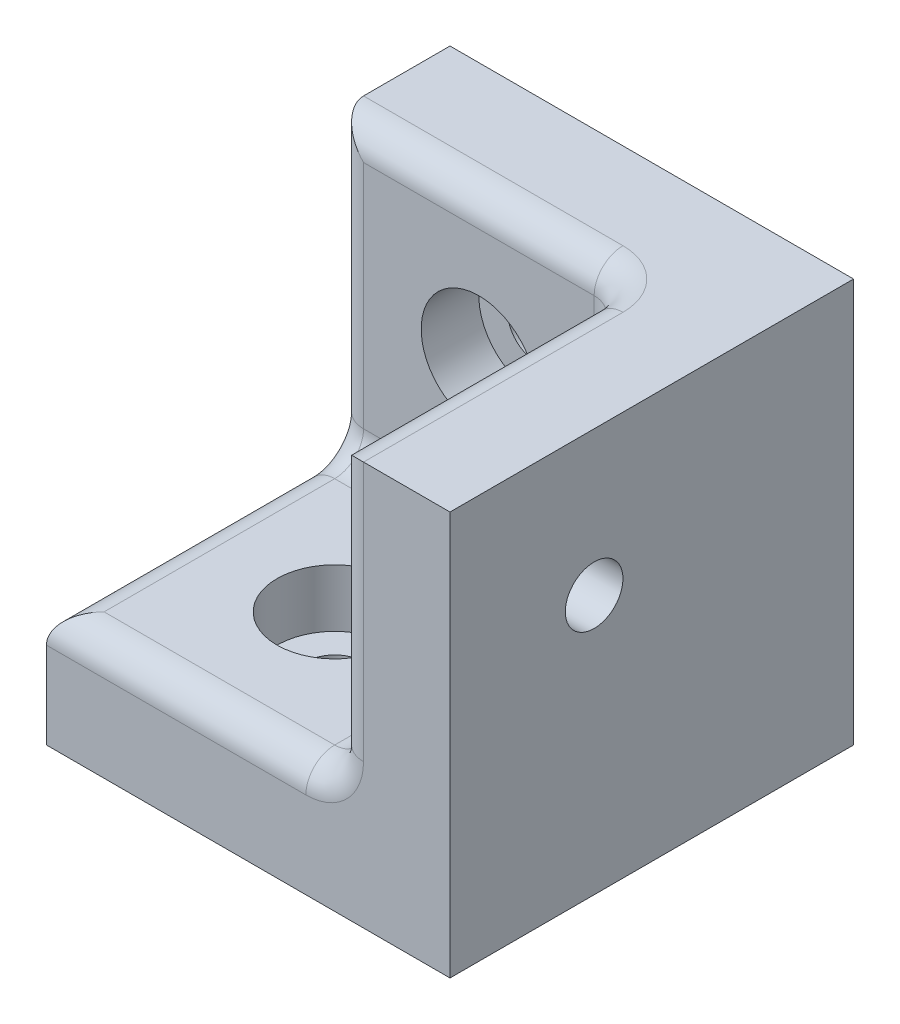
ISO-10303-21;
HEADER;
FILE_DESCRIPTION(('STEP AP214'),'2;1');
FILE_NAME('part.step','',(''),(''),'','','');
FILE_SCHEMA(('AUTOMOTIVE_DESIGN { 1 0 10303 214 1 1 1 1 }'));
ENDSEC;
DATA;
#1=APPLICATION_CONTEXT('core data for automotive mechanical design processes');
#2=APPLICATION_PROTOCOL_DEFINITION('international standard','automotive_design',2000,#1);
#3=PRODUCT_CONTEXT('',#1,'mechanical');
#4=PRODUCT('Part','Part','',(#3));
#5=PRODUCT_RELATED_PRODUCT_CATEGORY('part','',(#4));
#6=PRODUCT_DEFINITION_FORMATION('','',#4);
#7=PRODUCT_DEFINITION_CONTEXT('part definition',#1,'design');
#8=PRODUCT_DEFINITION('design','',#6,#7);
#9=PRODUCT_DEFINITION_SHAPE('','',#8);
#10=(LENGTH_UNIT() NAMED_UNIT(*) SI_UNIT(.MILLI.,.METRE.));
#11=(NAMED_UNIT(*) PLANE_ANGLE_UNIT() SI_UNIT($,.RADIAN.));
#12=(NAMED_UNIT(*) SI_UNIT($,.STERADIAN.) SOLID_ANGLE_UNIT());
#13=UNCERTAINTY_MEASURE_WITH_UNIT(LENGTH_MEASURE(1.E-05),#10,'distance_accuracy_value','');
#14=(GEOMETRIC_REPRESENTATION_CONTEXT(3) GLOBAL_UNCERTAINTY_ASSIGNED_CONTEXT((#13)) GLOBAL_UNIT_ASSIGNED_CONTEXT((#10,
#11,#12)) REPRESENTATION_CONTEXT('',''));
#15=CARTESIAN_POINT('',(0.,0.,0.));
#16=DIRECTION('',(0.,0.,1.));
#17=DIRECTION('',(1.,0.,0.));
#18=AXIS2_PLACEMENT_3D('',#15,#16,#17);
#19=CARTESIAN_POINT('',(9.,9.,9.));
#20=DIRECTION('',(-1.,0.,0.));
#21=DIRECTION('',(0.,0.,1.));
#22=AXIS2_PLACEMENT_3D('',#19,#20,#21);
#23=CYLINDRICAL_SURFACE('',#22,1.);
#24=CARTESIAN_POINT('',(9.,9.,9.));
#25=DIRECTION('',(-1.,0.,0.));
#26=DIRECTION('',(0.,0.,1.));
#27=AXIS2_PLACEMENT_3D('',#24,#25,#26);
#28=CIRCLE('',#27,1.);
#29=CARTESIAN_POINT('',(9.,9.,10.));
#30=VERTEX_POINT('',#29);
#31=EDGE_CURVE('E162',#30,#30,#28,.T.);
#32=ORIENTED_EDGE('',*,*,#31,.F.);
#33=EDGE_LOOP('',(#32));
#34=FACE_BOUND('',#33,.T.);
#35=CARTESIAN_POINT('',(7.,9.,9.));
#36=DIRECTION('',(-1.,0.,0.));
#37=DIRECTION('',(0.,0.,1.));
#38=AXIS2_PLACEMENT_3D('',#35,#36,#37);
#39=CIRCLE('',#38,1.);
#40=CARTESIAN_POINT('',(7.,9.,10.));
#41=VERTEX_POINT('',#40);
#42=EDGE_CURVE('E165',#41,#41,#39,.F.);
#43=ORIENTED_EDGE('',*,*,#42,.F.);
#44=EDGE_LOOP('',(#43));
#45=FACE_BOUND('',#44,.T.);
#46=ADVANCED_FACE('F35',(#34,#45),#23,.F.);
#47=CARTESIAN_POINT('',(0.,0.,9.));
#48=DIRECTION('',(0.,1.,0.));
#49=DIRECTION('',(0.,0.,1.));
#50=AXIS2_PLACEMENT_3D('',#47,#48,#49);
#51=CYLINDRICAL_SURFACE('',#50,1.);
#52=CARTESIAN_POINT('',(0.,0.,9.));
#53=DIRECTION('',(0.,1.,0.));
#54=DIRECTION('',(0.,0.,1.));
#55=AXIS2_PLACEMENT_3D('',#52,#53,#54);
#56=CIRCLE('',#55,1.);
#57=CARTESIAN_POINT('',(0.,0.,10.));
#58=VERTEX_POINT('',#57);
#59=EDGE_CURVE('E188',#58,#58,#56,.T.);
#60=ORIENTED_EDGE('',*,*,#59,.F.);
#61=EDGE_LOOP('',(#60));
#62=FACE_BOUND('',#61,.T.);
#63=CARTESIAN_POINT('',(0.,2.,9.));
#64=DIRECTION('',(0.,1.,0.));
#65=DIRECTION('',(0.,0.,1.));
#66=AXIS2_PLACEMENT_3D('',#63,#64,#65);
#67=CIRCLE('',#66,1.);
#68=CARTESIAN_POINT('',(0.,2.,10.));
#69=VERTEX_POINT('',#68);
#70=EDGE_CURVE('E178',#69,#69,#67,.F.);
#71=ORIENTED_EDGE('',*,*,#70,.F.);
#72=EDGE_LOOP('',(#71));
#73=FACE_BOUND('',#72,.T.);
#74=ADVANCED_FACE('F322',(#62,#73),#51,.F.);
#75=CARTESIAN_POINT('',(0.,9.,0.));
#76=DIRECTION('',(0.,0.,1.));
#77=DIRECTION('',(1.,0.,0.));
#78=AXIS2_PLACEMENT_3D('',#75,#76,#77);
#79=CYLINDRICAL_SURFACE('',#78,1.);
#80=CARTESIAN_POINT('',(0.,9.,0.));
#81=DIRECTION('',(0.,0.,1.));
#82=DIRECTION('',(1.,0.,0.));
#83=AXIS2_PLACEMENT_3D('',#80,#81,#82);
#84=CIRCLE('',#83,1.);
#85=CARTESIAN_POINT('',(1.,9.,0.));
#86=VERTEX_POINT('',#85);
#87=EDGE_CURVE('E191',#86,#86,#84,.T.);
#88=ORIENTED_EDGE('',*,*,#87,.F.);
#89=EDGE_LOOP('',(#88));
#90=FACE_BOUND('',#89,.T.);
#91=CARTESIAN_POINT('',(0.,9.,2.));
#92=DIRECTION('',(0.,0.,1.));
#93=DIRECTION('',(1.,0.,0.));
#94=AXIS2_PLACEMENT_3D('',#91,#92,#93);
#95=CIRCLE('',#94,1.);
#96=CARTESIAN_POINT('',(1.,9.,2.));
#97=VERTEX_POINT('',#96);
#98=EDGE_CURVE('E184',#97,#97,#95,.F.);
#99=ORIENTED_EDGE('',*,*,#98,.F.);
#100=EDGE_LOOP('',(#99));
#101=FACE_BOUND('',#100,.T.);
#102=ADVANCED_FACE('F327',(#90,#101),#79,.F.);
#103=CARTESIAN_POINT('',(-5.,14.,4.));
#104=DIRECTION('',(1.,0.,0.));
#105=DIRECTION('',(0.,1.,0.));
#106=AXIS2_PLACEMENT_3D('',#103,#104,#105);
#107=PLANE('',#106);
#108=CARTESIAN_POINT('',(-5.,5.,5.));
#109=DIRECTION('',(1.,0.,0.));
#110=DIRECTION('',(0.,1.,0.));
#111=AXIS2_PLACEMENT_3D('',#108,#109,#110);
#112=CIRCLE('',#111,2.);
#113=CARTESIAN_POINT('',(-5.,5.,3.));
#114=VERTEX_POINT('',#113);
#115=CARTESIAN_POINT('',(-5.,3.,5.));
#116=VERTEX_POINT('',#115);
#117=EDGE_CURVE('E243',#114,#116,#112,.F.);
#118=ORIENTED_EDGE('',*,*,#117,.F.);
#119=DIRECTION('',(0.,-1.,0.));
#120=VECTOR('',#119,1.);
#121=CARTESIAN_POINT('',(-5.,14.,3.));
#122=LINE('',#121,#120);
#123=CARTESIAN_POINT('',(-5.,14.,3.));
#124=VERTEX_POINT('',#123);
#125=EDGE_CURVE('E248',#114,#124,#122,.F.);
#126=ORIENTED_EDGE('',*,*,#125,.T.);
#127=DIRECTION('',(0.,0.,-1.));
#128=VECTOR('',#127,1.);
#129=CARTESIAN_POINT('',(-5.,14.,4.));
#130=LINE('',#129,#128);
#131=CARTESIAN_POINT('',(-5.,14.,0.));
#132=VERTEX_POINT('',#131);
#133=EDGE_CURVE('E200',#124,#132,#130,.T.);
#134=ORIENTED_EDGE('',*,*,#133,.T.);
#135=DIRECTION('',(0.,-1.,0.));
#136=VECTOR('',#135,1.);
#137=CARTESIAN_POINT('',(-5.,14.,0.));
#138=LINE('',#137,#136);
#139=CARTESIAN_POINT('',(-5.,0.,0.));
#140=VERTEX_POINT('',#139);
#141=EDGE_CURVE('E148',#132,#140,#138,.T.);
#142=ORIENTED_EDGE('',*,*,#141,.T.);
#143=DIRECTION('',(0.,0.,-1.));
#144=VECTOR('',#143,1.);
#145=CARTESIAN_POINT('',(-5.,0.,4.));
#146=LINE('',#145,#144);
#147=CARTESIAN_POINT('',(-5.,0.,14.));
#148=VERTEX_POINT('',#147);
#149=EDGE_CURVE('E143',#148,#140,#146,.T.);
#150=ORIENTED_EDGE('',*,*,#149,.F.);
#151=DIRECTION('',(0.,-1.,0.));
#152=VECTOR('',#151,1.);
#153=CARTESIAN_POINT('',(-5.,0.,14.));
#154=LINE('',#153,#152);
#155=CARTESIAN_POINT('',(-5.,3.,14.));
#156=VERTEX_POINT('',#155);
#157=EDGE_CURVE('E194',#156,#148,#154,.T.);
#158=ORIENTED_EDGE('',*,*,#157,.F.);
#159=DIRECTION('',(0.,0.,-1.));
#160=VECTOR('',#159,1.);
#161=CARTESIAN_POINT('',(-5.,3.,4.));
#162=LINE('',#161,#160);
#163=EDGE_CURVE('E246',#156,#116,#162,.T.);
#164=ORIENTED_EDGE('',*,*,#163,.T.);
#165=EDGE_LOOP('',(#118,#126,#134,#142,#150,#158,#164));
#166=FACE_BOUND('',#165,.T.);
#167=ADVANCED_FACE('F358',(#166),#107,.F.);
#168=CARTESIAN_POINT('',(-5.,0.,4.));
#169=DIRECTION('',(0.,1.,0.));
#170=DIRECTION('',(0.,0.,1.));
#171=AXIS2_PLACEMENT_3D('',#168,#169,#170);
#172=PLANE('',#171);
#173=ORIENTED_EDGE('',*,*,#59,.T.);
#174=EDGE_LOOP('',(#173));
#175=FACE_BOUND('',#174,.T.);
#176=DIRECTION('',(1.,0.,0.));
#177=VECTOR('',#176,1.);
#178=CARTESIAN_POINT('',(-5.,0.,0.));
#179=LINE('',#178,#177);
#180=CARTESIAN_POINT('',(9.,0.,0.));
#181=VERTEX_POINT('',#180);
#182=EDGE_CURVE('E136',#140,#181,#179,.T.);
#183=ORIENTED_EDGE('',*,*,#182,.T.);
#184=DIRECTION('',(0.,0.,-1.));
#185=VECTOR('',#184,1.);
#186=CARTESIAN_POINT('',(9.,0.,14.));
#187=LINE('',#186,#185);
#188=CARTESIAN_POINT('',(9.,0.,14.));
#189=VERTEX_POINT('',#188);
#190=EDGE_CURVE('E141',#189,#181,#187,.T.);
#191=ORIENTED_EDGE('',*,*,#190,.F.);
#192=DIRECTION('',(1.,0.,0.));
#193=VECTOR('',#192,1.);
#194=CARTESIAN_POINT('',(-5.,0.,14.));
#195=LINE('',#194,#193);
#196=EDGE_CURVE('E196',#148,#189,#195,.T.);
#197=ORIENTED_EDGE('',*,*,#196,.F.);
#198=ORIENTED_EDGE('',*,*,#149,.T.);
#199=EDGE_LOOP('',(#183,#191,#197,#198));
#200=FACE_BOUND('',#199,.T.);
#201=ADVANCED_FACE('F138',(#175,#200),#172,.F.);
#202=CARTESIAN_POINT('',(-5.,14.,4.));
#203=DIRECTION('',(0.,-1.,0.));
#204=DIRECTION('',(0.,0.,-1.));
#205=AXIS2_PLACEMENT_3D('',#202,#203,#204);
#206=PLANE('',#205);
#207=CARTESIAN_POINT('',(4.,14.,5.));
#208=DIRECTION('',(0.,-1.,0.));
#209=DIRECTION('',(0.,0.,-1.));
#210=AXIS2_PLACEMENT_3D('',#207,#208,#209);
#211=CIRCLE('',#210,2.);
#212=CARTESIAN_POINT('',(6.,14.,5.));
#213=VERTEX_POINT('',#212);
#214=CARTESIAN_POINT('',(4.,14.,3.));
#215=VERTEX_POINT('',#214);
#216=EDGE_CURVE('E203',#213,#215,#211,.F.);
#217=ORIENTED_EDGE('',*,*,#216,.F.);
#218=DIRECTION('',(0.,0.,1.));
#219=VECTOR('',#218,1.);
#220=CARTESIAN_POINT('',(6.,14.,4.));
#221=LINE('',#220,#219);
#222=CARTESIAN_POINT('',(6.,14.,14.));
#223=VERTEX_POINT('',#222);
#224=EDGE_CURVE('E215',#213,#223,#221,.T.);
#225=ORIENTED_EDGE('',*,*,#224,.T.);
#226=DIRECTION('',(-1.,0.,0.));
#227=VECTOR('',#226,1.);
#228=CARTESIAN_POINT('',(9.,14.,14.));
#229=LINE('',#228,#227);
#230=CARTESIAN_POINT('',(9.,14.,14.));
#231=VERTEX_POINT('',#230);
#232=EDGE_CURVE('E171',#231,#223,#229,.T.);
#233=ORIENTED_EDGE('',*,*,#232,.F.);
#234=DIRECTION('',(0.,0.,1.));
#235=VECTOR('',#234,1.);
#236=CARTESIAN_POINT('',(9.,14.,0.));
#237=LINE('',#236,#235);
#238=CARTESIAN_POINT('',(9.,14.,0.));
#239=VERTEX_POINT('',#238);
#240=EDGE_CURVE('E156',#239,#231,#237,.T.);
#241=ORIENTED_EDGE('',*,*,#240,.F.);
#242=DIRECTION('',(-1.,0.,0.));
#243=VECTOR('',#242,1.);
#244=CARTESIAN_POINT('',(-5.,14.,0.));
#245=LINE('',#244,#243);
#246=EDGE_CURVE('E147',#239,#132,#245,.T.);
#247=ORIENTED_EDGE('',*,*,#246,.T.);
#248=ORIENTED_EDGE('',*,*,#133,.F.);
#249=DIRECTION('',(-1.,0.,0.));
#250=VECTOR('',#249,1.);
#251=CARTESIAN_POINT('',(5.,14.,3.));
#252=LINE('',#251,#250);
#253=EDGE_CURVE('E213',#124,#215,#252,.F.);
#254=ORIENTED_EDGE('',*,*,#253,.T.);
#255=EDGE_LOOP('',(#217,#225,#233,#241,#247,#248,#254));
#256=FACE_BOUND('',#255,.T.);
#257=ADVANCED_FACE('F369',(#256),#206,.F.);
#258=CARTESIAN_POINT('',(0.,0.,4.));
#259=DIRECTION('',(0.,0.,1.));
#260=DIRECTION('',(1.,0.,0.));
#261=AXIS2_PLACEMENT_3D('',#258,#259,#260);
#262=PLANE('',#261);
#263=DIRECTION('',(0.,1.,0.));
#264=VECTOR('',#263,1.);
#265=CARTESIAN_POINT('',(4.,0.,4.));
#266=LINE('',#265,#264);
#267=CARTESIAN_POINT('',(4.,5.,4.));
#268=VERTEX_POINT('',#267);
#269=CARTESIAN_POINT('',(4.,13.,4.));
#270=VERTEX_POINT('',#269);
#271=EDGE_CURVE('E236',#268,#270,#266,.T.);
#272=ORIENTED_EDGE('',*,*,#271,.T.);
#273=DIRECTION('',(-1.,0.,0.));
#274=VECTOR('',#273,1.);
#275=CARTESIAN_POINT('',(-5.,13.,4.));
#276=LINE('',#275,#274);
#277=CARTESIAN_POINT('',(-4.,13.,4.));
#278=VERTEX_POINT('',#277);
#279=EDGE_CURVE('E241',#270,#278,#276,.T.);
#280=ORIENTED_EDGE('',*,*,#279,.T.);
#281=DIRECTION('',(0.,-1.,0.));
#282=VECTOR('',#281,1.);
#283=CARTESIAN_POINT('',(-4.,4.,4.));
#284=LINE('',#283,#282);
#285=CARTESIAN_POINT('',(-4.,5.,4.));
#286=VERTEX_POINT('',#285);
#287=EDGE_CURVE('E238',#278,#286,#284,.T.);
#288=ORIENTED_EDGE('',*,*,#287,.T.);
#289=DIRECTION('',(-1.,0.,0.));
#290=VECTOR('',#289,1.);
#291=CARTESIAN_POINT('',(0.,5.,4.));
#292=LINE('',#291,#290);
#293=EDGE_CURVE('E234',#286,#268,#292,.F.);
#294=ORIENTED_EDGE('',*,*,#293,.T.);
#295=EDGE_LOOP('',(#272,#280,#288,#294));
#296=FACE_BOUND('',#295,.T.);
#297=CARTESIAN_POINT('',(0.,9.,4.));
#298=DIRECTION('',(0.,0.,1.));
#299=DIRECTION('',(1.,0.,0.));
#300=AXIS2_PLACEMENT_3D('',#297,#298,#299);
#301=CIRCLE('',#300,2.);
#302=CARTESIAN_POINT('',(2.,9.,4.));
#303=VERTEX_POINT('',#302);
#304=EDGE_CURVE('E185',#303,#303,#301,.T.);
#305=ORIENTED_EDGE('',*,*,#304,.F.);
#306=EDGE_LOOP('',(#305));
#307=FACE_BOUND('',#306,.T.);
#308=ADVANCED_FACE('F366',(#296,#307),#262,.T.);
#309=CARTESIAN_POINT('',(0.,0.,0.));
#310=DIRECTION('',(0.,0.,1.));
#311=DIRECTION('',(1.,0.,0.));
#312=AXIS2_PLACEMENT_3D('',#309,#310,#311);
#313=PLANE('',#312);
#314=ORIENTED_EDGE('',*,*,#87,.T.);
#315=EDGE_LOOP('',(#314));
#316=FACE_BOUND('',#315,.T.);
#317=ORIENTED_EDGE('',*,*,#141,.F.);
#318=ORIENTED_EDGE('',*,*,#246,.F.);
#319=DIRECTION('',(0.,1.,0.));
#320=VECTOR('',#319,1.);
#321=CARTESIAN_POINT('',(9.,0.,0.));
#322=LINE('',#321,#320);
#323=EDGE_CURVE('E151',#181,#239,#322,.T.);
#324=ORIENTED_EDGE('',*,*,#323,.F.);
#325=ORIENTED_EDGE('',*,*,#182,.F.);
#326=EDGE_LOOP('',(#317,#318,#324,#325));
#327=FACE_BOUND('',#326,.T.);
#328=ADVANCED_FACE('F152',(#316,#327),#313,.F.);
#329=CARTESIAN_POINT('',(-5.,4.,14.));
#330=DIRECTION('',(0.,-1.,0.));
#331=DIRECTION('',(0.,0.,-1.));
#332=AXIS2_PLACEMENT_3D('',#329,#330,#331);
#333=PLANE('',#332);
#334=DIRECTION('',(-1.,0.,0.));
#335=VECTOR('',#334,1.);
#336=CARTESIAN_POINT('',(-5.,4.,13.));
#337=LINE('',#336,#335);
#338=CARTESIAN_POINT('',(-4.,4.,13.));
#339=VERTEX_POINT('',#338);
#340=CARTESIAN_POINT('',(4.,4.,13.));
#341=VERTEX_POINT('',#340);
#342=EDGE_CURVE('E44',#339,#341,#337,.F.);
#343=ORIENTED_EDGE('',*,*,#342,.T.);
#344=DIRECTION('',(0.,0.,-1.));
#345=VECTOR('',#344,1.);
#346=CARTESIAN_POINT('',(4.,4.,4.));
#347=LINE('',#346,#345);
#348=CARTESIAN_POINT('',(4.,4.,5.));
#349=VERTEX_POINT('',#348);
#350=EDGE_CURVE('E11',#341,#349,#347,.T.);
#351=ORIENTED_EDGE('',*,*,#350,.T.);
#352=DIRECTION('',(-1.,0.,0.));
#353=VECTOR('',#352,1.);
#354=CARTESIAN_POINT('',(-5.,4.,5.));
#355=LINE('',#354,#353);
#356=CARTESIAN_POINT('',(-4.,4.,5.));
#357=VERTEX_POINT('',#356);
#358=EDGE_CURVE('E250',#349,#357,#355,.T.);
#359=ORIENTED_EDGE('',*,*,#358,.T.);
#360=DIRECTION('',(0.,0.,-1.));
#361=VECTOR('',#360,1.);
#362=CARTESIAN_POINT('',(-4.,4.,14.));
#363=LINE('',#362,#361);
#364=EDGE_CURVE('E55',#357,#339,#363,.F.);
#365=ORIENTED_EDGE('',*,*,#364,.T.);
#366=EDGE_LOOP('',(#343,#351,#359,#365));
#367=FACE_BOUND('',#366,.T.);
#368=CARTESIAN_POINT('',(0.,4.,9.));
#369=DIRECTION('',(0.,1.,0.));
#370=DIRECTION('',(0.,0.,1.));
#371=AXIS2_PLACEMENT_3D('',#368,#369,#370);
#372=CIRCLE('',#371,2.);
#373=CARTESIAN_POINT('',(0.,4.,11.));
#374=VERTEX_POINT('',#373);
#375=EDGE_CURVE('E174',#374,#374,#372,.T.);
#376=ORIENTED_EDGE('',*,*,#375,.F.);
#377=EDGE_LOOP('',(#376));
#378=FACE_BOUND('',#377,.T.);
#379=ADVANCED_FACE('F362',(#367,#378),#333,.F.);
#380=CARTESIAN_POINT('',(0.,0.,14.));
#381=DIRECTION('',(0.,0.,-1.));
#382=DIRECTION('',(-1.,0.,0.));
#383=AXIS2_PLACEMENT_3D('',#380,#381,#382);
#384=PLANE('',#383);
#385=ORIENTED_EDGE('',*,*,#232,.T.);
#386=DIRECTION('',(0.,-1.,0.));
#387=VECTOR('',#386,1.);
#388=CARTESIAN_POINT('',(6.,0.,14.));
#389=LINE('',#388,#387);
#390=CARTESIAN_POINT('',(6.,5.,14.));
#391=VERTEX_POINT('',#390);
#392=EDGE_CURVE('E232',#223,#391,#389,.T.);
#393=ORIENTED_EDGE('',*,*,#392,.T.);
#394=CARTESIAN_POINT('',(4.,5.,14.));
#395=DIRECTION('',(0.,0.,-1.));
#396=DIRECTION('',(-1.,0.,0.));
#397=AXIS2_PLACEMENT_3D('',#394,#395,#396);
#398=CIRCLE('',#397,2.);
#399=CARTESIAN_POINT('',(4.,3.,14.));
#400=VERTEX_POINT('',#399);
#401=EDGE_CURVE('E229',#400,#391,#398,.F.);
#402=ORIENTED_EDGE('',*,*,#401,.F.);
#403=DIRECTION('',(-1.,0.,0.));
#404=VECTOR('',#403,1.);
#405=CARTESIAN_POINT('',(0.,3.,14.));
#406=LINE('',#405,#404);
#407=EDGE_CURVE('E227',#400,#156,#406,.T.);
#408=ORIENTED_EDGE('',*,*,#407,.T.);
#409=ORIENTED_EDGE('',*,*,#157,.T.);
#410=ORIENTED_EDGE('',*,*,#196,.T.);
#411=DIRECTION('',(0.,-1.,0.));
#412=VECTOR('',#411,1.);
#413=CARTESIAN_POINT('',(9.,0.,14.));
#414=LINE('',#413,#412);
#415=EDGE_CURVE('E161',#231,#189,#414,.T.);
#416=ORIENTED_EDGE('',*,*,#415,.F.);
#417=EDGE_LOOP('',(#385,#393,#402,#408,#409,#410,#416));
#418=FACE_BOUND('',#417,.T.);
#419=ADVANCED_FACE('F351',(#418),#384,.F.);
#420=CARTESIAN_POINT('',(0.,9.,2.));
#421=DIRECTION('',(0.,0.,1.));
#422=DIRECTION('',(1.,0.,0.));
#423=AXIS2_PLACEMENT_3D('',#420,#421,#422);
#424=PLANE('',#423);
#425=CARTESIAN_POINT('',(0.,9.,2.));
#426=DIRECTION('',(0.,0.,1.));
#427=DIRECTION('',(1.,0.,0.));
#428=AXIS2_PLACEMENT_3D('',#425,#426,#427);
#429=CIRCLE('',#428,2.);
#430=CARTESIAN_POINT('',(2.,9.,2.));
#431=VERTEX_POINT('',#430);
#432=EDGE_CURVE('E181',#431,#431,#429,.T.);
#433=ORIENTED_EDGE('',*,*,#432,.T.);
#434=EDGE_LOOP('',(#433));
#435=FACE_BOUND('',#434,.T.);
#436=ORIENTED_EDGE('',*,*,#98,.T.);
#437=EDGE_LOOP('',(#436));
#438=FACE_BOUND('',#437,.T.);
#439=ADVANCED_FACE('F348',(#435,#438),#424,.T.);
#440=CARTESIAN_POINT('',(0.,9.,2.));
#441=DIRECTION('',(0.,0.,1.));
#442=DIRECTION('',(1.,0.,0.));
#443=AXIS2_PLACEMENT_3D('',#440,#441,#442);
#444=CYLINDRICAL_SURFACE('',#443,2.);
#445=ORIENTED_EDGE('',*,*,#432,.F.);
#446=EDGE_LOOP('',(#445));
#447=FACE_BOUND('',#446,.T.);
#448=ORIENTED_EDGE('',*,*,#304,.T.);
#449=EDGE_LOOP('',(#448));
#450=FACE_BOUND('',#449,.T.);
#451=ADVANCED_FACE('F343',(#447,#450),#444,.F.);
#452=CARTESIAN_POINT('',(0.,2.,9.));
#453=DIRECTION('',(0.,1.,0.));
#454=DIRECTION('',(0.,0.,1.));
#455=AXIS2_PLACEMENT_3D('',#452,#453,#454);
#456=PLANE('',#455);
#457=CARTESIAN_POINT('',(0.,2.,9.));
#458=DIRECTION('',(0.,1.,0.));
#459=DIRECTION('',(0.,0.,1.));
#460=AXIS2_PLACEMENT_3D('',#457,#458,#459);
#461=CIRCLE('',#460,2.);
#462=CARTESIAN_POINT('',(0.,2.,11.));
#463=VERTEX_POINT('',#462);
#464=EDGE_CURVE('E175',#463,#463,#461,.T.);
#465=ORIENTED_EDGE('',*,*,#464,.T.);
#466=EDGE_LOOP('',(#465));
#467=FACE_BOUND('',#466,.T.);
#468=ORIENTED_EDGE('',*,*,#70,.T.);
#469=EDGE_LOOP('',(#468));
#470=FACE_BOUND('',#469,.T.);
#471=ADVANCED_FACE('F340',(#467,#470),#456,.T.);
#472=CARTESIAN_POINT('',(0.,2.,9.));
#473=DIRECTION('',(0.,1.,0.));
#474=DIRECTION('',(0.,0.,1.));
#475=AXIS2_PLACEMENT_3D('',#472,#473,#474);
#476=CYLINDRICAL_SURFACE('',#475,2.);
#477=ORIENTED_EDGE('',*,*,#464,.F.);
#478=EDGE_LOOP('',(#477));
#479=FACE_BOUND('',#478,.T.);
#480=ORIENTED_EDGE('',*,*,#375,.T.);
#481=EDGE_LOOP('',(#480));
#482=FACE_BOUND('',#481,.T.);
#483=ADVANCED_FACE('F335',(#479,#482),#476,.F.);
#484=CARTESIAN_POINT('',(9.,0.,0.));
#485=DIRECTION('',(1.,0.,0.));
#486=DIRECTION('',(0.,0.,-1.));
#487=AXIS2_PLACEMENT_3D('',#484,#485,#486);
#488=PLANE('',#487);
#489=ORIENTED_EDGE('',*,*,#31,.T.);
#490=EDGE_LOOP('',(#489));
#491=FACE_BOUND('',#490,.T.);
#492=ORIENTED_EDGE('',*,*,#190,.T.);
#493=ORIENTED_EDGE('',*,*,#323,.T.);
#494=ORIENTED_EDGE('',*,*,#240,.T.);
#495=ORIENTED_EDGE('',*,*,#415,.T.);
#496=EDGE_LOOP('',(#492,#493,#494,#495));
#497=FACE_BOUND('',#496,.T.);
#498=ADVANCED_FACE('F159',(#491,#497),#488,.T.);
#499=CARTESIAN_POINT('',(5.,0.,0.));
#500=DIRECTION('',(1.,0.,0.));
#501=DIRECTION('',(0.,0.,-1.));
#502=AXIS2_PLACEMENT_3D('',#499,#500,#501);
#503=PLANE('',#502);
#504=DIRECTION('',(0.,-1.,0.));
#505=VECTOR('',#504,1.);
#506=CARTESIAN_POINT('',(5.,0.,13.));
#507=LINE('',#506,#505);
#508=CARTESIAN_POINT('',(5.,5.,13.));
#509=VERTEX_POINT('',#508);
#510=CARTESIAN_POINT('',(5.,13.,13.));
#511=VERTEX_POINT('',#510);
#512=EDGE_CURVE('E222',#509,#511,#507,.F.);
#513=ORIENTED_EDGE('',*,*,#512,.T.);
#514=DIRECTION('',(0.,0.,1.));
#515=VECTOR('',#514,1.);
#516=CARTESIAN_POINT('',(5.,13.,0.));
#517=LINE('',#516,#515);
#518=CARTESIAN_POINT('',(5.,13.,5.));
#519=VERTEX_POINT('',#518);
#520=EDGE_CURVE('E224',#511,#519,#517,.F.);
#521=ORIENTED_EDGE('',*,*,#520,.T.);
#522=DIRECTION('',(0.,1.,0.));
#523=VECTOR('',#522,1.);
#524=CARTESIAN_POINT('',(5.,0.,5.));
#525=LINE('',#524,#523);
#526=CARTESIAN_POINT('',(5.,5.,5.));
#527=VERTEX_POINT('',#526);
#528=EDGE_CURVE('E220',#519,#527,#525,.F.);
#529=ORIENTED_EDGE('',*,*,#528,.T.);
#530=DIRECTION('',(0.,0.,-1.));
#531=VECTOR('',#530,1.);
#532=CARTESIAN_POINT('',(5.,5.,14.));
#533=LINE('',#532,#531);
#534=EDGE_CURVE('E218',#527,#509,#533,.F.);
#535=ORIENTED_EDGE('',*,*,#534,.T.);
#536=EDGE_LOOP('',(#513,#521,#529,#535));
#537=FACE_BOUND('',#536,.T.);
#538=CARTESIAN_POINT('',(5.,9.,9.));
#539=DIRECTION('',(-1.,0.,0.));
#540=DIRECTION('',(0.,0.,1.));
#541=AXIS2_PLACEMENT_3D('',#538,#539,#540);
#542=CIRCLE('',#541,2.);
#543=CARTESIAN_POINT('',(5.,9.,11.));
#544=VERTEX_POINT('',#543);
#545=EDGE_CURVE('E294',#544,#544,#542,.T.);
#546=ORIENTED_EDGE('',*,*,#545,.F.);
#547=EDGE_LOOP('',(#546));
#548=FACE_BOUND('',#547,.T.);
#549=ADVANCED_FACE('F318',(#537,#548),#503,.F.);
#550=CARTESIAN_POINT('',(7.,9.,9.));
#551=DIRECTION('',(-1.,0.,0.));
#552=DIRECTION('',(0.,0.,1.));
#553=AXIS2_PLACEMENT_3D('',#550,#551,#552);
#554=PLANE('',#553);
#555=CARTESIAN_POINT('',(7.,9.,9.));
#556=DIRECTION('',(-1.,0.,0.));
#557=DIRECTION('',(0.,0.,1.));
#558=AXIS2_PLACEMENT_3D('',#555,#556,#557);
#559=CIRCLE('',#558,2.);
#560=CARTESIAN_POINT('',(7.,9.,11.));
#561=VERTEX_POINT('',#560);
#562=EDGE_CURVE('E210',#561,#561,#559,.T.);
#563=ORIENTED_EDGE('',*,*,#562,.T.);
#564=EDGE_LOOP('',(#563));
#565=FACE_BOUND('',#564,.T.);
#566=ORIENTED_EDGE('',*,*,#42,.T.);
#567=EDGE_LOOP('',(#566));
#568=FACE_BOUND('',#567,.T.);
#569=ADVANCED_FACE('F306',(#565,#568),#554,.T.);
#570=CARTESIAN_POINT('',(7.,9.,9.));
#571=DIRECTION('',(-1.,0.,0.));
#572=DIRECTION('',(0.,0.,1.));
#573=AXIS2_PLACEMENT_3D('',#570,#571,#572);
#574=CYLINDRICAL_SURFACE('',#573,2.);
#575=ORIENTED_EDGE('',*,*,#562,.F.);
#576=EDGE_LOOP('',(#575));
#577=FACE_BOUND('',#576,.T.);
#578=ORIENTED_EDGE('',*,*,#545,.T.);
#579=EDGE_LOOP('',(#578));
#580=FACE_BOUND('',#579,.T.);
#581=ADVANCED_FACE('F309',(#577,#580),#574,.F.);
#582=CARTESIAN_POINT('',(-5.,5.,5.));
#583=DIRECTION('',(-1.,0.,0.));
#584=DIRECTION('',(0.,0.,1.));
#585=AXIS2_PLACEMENT_3D('',#582,#583,#584);
#586=CYLINDRICAL_SURFACE('',#585,1.);
#587=CARTESIAN_POINT('',(-4.,5.,5.));
#588=DIRECTION('',(1.,0.,0.));
#589=DIRECTION('',(0.,1.,0.));
#590=AXIS2_PLACEMENT_3D('',#587,#588,#589);
#591=CIRCLE('',#590,1.);
#592=EDGE_CURVE('E39',#357,#286,#591,.T.);
#593=ORIENTED_EDGE('',*,*,#592,.F.);
#594=ORIENTED_EDGE('',*,*,#358,.F.);
#595=CARTESIAN_POINT('',(4.,5.,5.));
#596=DIRECTION('',(-1.,0.,0.));
#597=DIRECTION('',(0.,0.,1.));
#598=AXIS2_PLACEMENT_3D('',#595,#596,#597);
#599=CIRCLE('',#598,1.);
#600=EDGE_CURVE('E286',#268,#349,#599,.T.);
#601=ORIENTED_EDGE('',*,*,#600,.F.);
#602=ORIENTED_EDGE('',*,*,#293,.F.);
#603=EDGE_LOOP('',(#593,#594,#601,#602));
#604=FACE_BOUND('',#603,.T.);
#605=ADVANCED_FACE('F37',(#604),#586,.F.);
#606=CARTESIAN_POINT('',(-4.,5.,5.));
#607=DIRECTION('',(1.,0.,0.));
#608=DIRECTION('',(0.,1.,0.));
#609=AXIS2_PLACEMENT_3D('',#606,#607,#608);
#610=TOROIDAL_SURFACE('',#609,2.,1.);
#611=CARTESIAN_POINT('',(-4.,5.,3.));
#612=DIRECTION('',(0.,-1.,0.));
#613=DIRECTION('',(0.,0.,-1.));
#614=AXIS2_PLACEMENT_3D('',#611,#612,#613);
#615=CIRCLE('',#614,1.);
#616=EDGE_CURVE('E284',#114,#286,#615,.F.);
#617=ORIENTED_EDGE('',*,*,#616,.F.);
#618=ORIENTED_EDGE('',*,*,#117,.T.);
#619=CARTESIAN_POINT('',(-4.,3.,5.));
#620=DIRECTION('',(0.,0.,-1.));
#621=DIRECTION('',(-1.,0.,0.));
#622=AXIS2_PLACEMENT_3D('',#619,#620,#621);
#623=CIRCLE('',#622,1.);
#624=EDGE_CURVE('E288',#357,#116,#623,.F.);
#625=ORIENTED_EDGE('',*,*,#624,.F.);
#626=ORIENTED_EDGE('',*,*,#592,.T.);
#627=EDGE_LOOP('',(#617,#618,#625,#626));
#628=FACE_BOUND('',#627,.T.);
#629=ADVANCED_FACE('F316',(#628),#610,.T.);
#630=CARTESIAN_POINT('',(-4.,3.,4.));
#631=DIRECTION('',(0.,0.,-1.));
#632=DIRECTION('',(-1.,0.,0.));
#633=AXIS2_PLACEMENT_3D('',#630,#631,#632);
#634=CYLINDRICAL_SURFACE('',#633,1.);
#635=ORIENTED_EDGE('',*,*,#624,.T.);
#636=ORIENTED_EDGE('',*,*,#163,.F.);
#637=CARTESIAN_POINT('',(-4.,3.,13.));
#638=DIRECTION('',(-0.707106781186547,0.,-0.707106781186547));
#639=DIRECTION('',(0.707106781186547,0.,-0.707106781186547));
#640=AXIS2_PLACEMENT_3D('',#637,#638,#639);
#641=ELLIPSE('',#640,1.41421356237309,1.);
#642=EDGE_CURVE('E281',#339,#156,#641,.F.);
#643=ORIENTED_EDGE('',*,*,#642,.F.);
#644=ORIENTED_EDGE('',*,*,#364,.F.);
#645=EDGE_LOOP('',(#635,#636,#643,#644));
#646=FACE_BOUND('',#645,.T.);
#647=ADVANCED_FACE('F422',(#646),#634,.T.);
#648=CARTESIAN_POINT('',(4.,5.,5.));
#649=DIRECTION('',(0.,0.,1.));
#650=DIRECTION('',(1.,0.,0.));
#651=AXIS2_PLACEMENT_3D('',#648,#649,#650);
#652=SPHERICAL_SURFACE('',#651,1.);
#653=CARTESIAN_POINT('',(4.,5.,5.));
#654=DIRECTION('',(0.,1.,0.));
#655=DIRECTION('',(0.,0.,1.));
#656=AXIS2_PLACEMENT_3D('',#653,#654,#655);
#657=CIRCLE('',#656,1.);
#658=EDGE_CURVE('E276',#268,#527,#657,.F.);
#659=ORIENTED_EDGE('',*,*,#658,.F.);
#660=ORIENTED_EDGE('',*,*,#600,.T.);
#661=CARTESIAN_POINT('',(4.,5.,5.));
#662=DIRECTION('',(0.,0.,1.));
#663=DIRECTION('',(1.,0.,0.));
#664=AXIS2_PLACEMENT_3D('',#661,#662,#663);
#665=CIRCLE('',#664,1.);
#666=EDGE_CURVE('E279',#527,#349,#665,.F.);
#667=ORIENTED_EDGE('',*,*,#666,.F.);
#668=EDGE_LOOP('',(#659,#660,#667));
#669=FACE_BOUND('',#668,.T.);
#670=ADVANCED_FACE('F418',(#669),#652,.F.);
#671=CARTESIAN_POINT('',(-4.,0.,3.));
#672=DIRECTION('',(0.,1.,0.));
#673=DIRECTION('',(-1.,0.,0.));
#674=AXIS2_PLACEMENT_3D('',#671,#672,#673);
#675=CYLINDRICAL_SURFACE('',#674,1.);
#676=ORIENTED_EDGE('',*,*,#616,.T.);
#677=ORIENTED_EDGE('',*,*,#287,.F.);
#678=CARTESIAN_POINT('',(-4.,13.,3.));
#679=DIRECTION('',(0.707106781186547,0.707106781186548,0.));
#680=DIRECTION('',(0.707106781186547,-0.707106781186547,0.));
#681=AXIS2_PLACEMENT_3D('',#678,#679,#680);
#682=ELLIPSE('',#681,1.4142135623731,1.);
#683=EDGE_CURVE('E273',#124,#278,#682,.T.);
#684=ORIENTED_EDGE('',*,*,#683,.F.);
#685=ORIENTED_EDGE('',*,*,#125,.F.);
#686=EDGE_LOOP('',(#676,#677,#684,#685));
#687=FACE_BOUND('',#686,.T.);
#688=ADVANCED_FACE('F414',(#687),#675,.T.);
#689=CARTESIAN_POINT('',(0.,3.,13.));
#690=DIRECTION('',(-1.,0.,0.));
#691=DIRECTION('',(0.,0.,1.));
#692=AXIS2_PLACEMENT_3D('',#689,#690,#691);
#693=CYLINDRICAL_SURFACE('',#692,1.);
#694=ORIENTED_EDGE('',*,*,#642,.T.);
#695=ORIENTED_EDGE('',*,*,#407,.F.);
#696=CARTESIAN_POINT('',(4.,3.,13.));
#697=DIRECTION('',(1.,0.,0.));
#698=DIRECTION('',(0.,0.,-1.));
#699=AXIS2_PLACEMENT_3D('',#696,#697,#698);
#700=CIRCLE('',#699,1.);
#701=EDGE_CURVE('E270',#341,#400,#700,.T.);
#702=ORIENTED_EDGE('',*,*,#701,.F.);
#703=ORIENTED_EDGE('',*,*,#342,.F.);
#704=EDGE_LOOP('',(#694,#695,#702,#703));
#705=FACE_BOUND('',#704,.T.);
#706=ADVANCED_FACE('F410',(#705),#693,.T.);
#707=CARTESIAN_POINT('',(4.,5.,14.));
#708=DIRECTION('',(0.,0.,1.));
#709=DIRECTION('',(1.,0.,0.));
#710=AXIS2_PLACEMENT_3D('',#707,#708,#709);
#711=CYLINDRICAL_SURFACE('',#710,1.);
#712=ORIENTED_EDGE('',*,*,#666,.T.);
#713=ORIENTED_EDGE('',*,*,#350,.F.);
#714=CARTESIAN_POINT('',(4.,5.,13.));
#715=DIRECTION('',(0.,0.,-1.));
#716=DIRECTION('',(-1.,0.,0.));
#717=AXIS2_PLACEMENT_3D('',#714,#715,#716);
#718=CIRCLE('',#717,1.);
#719=EDGE_CURVE('E267',#509,#341,#718,.T.);
#720=ORIENTED_EDGE('',*,*,#719,.F.);
#721=ORIENTED_EDGE('',*,*,#534,.F.);
#722=EDGE_LOOP('',(#712,#713,#720,#721));
#723=FACE_BOUND('',#722,.T.);
#724=ADVANCED_FACE('F406',(#723),#711,.F.);
#725=CARTESIAN_POINT('',(4.,0.,5.));
#726=DIRECTION('',(0.,1.,0.));
#727=DIRECTION('',(0.,0.,1.));
#728=AXIS2_PLACEMENT_3D('',#725,#726,#727);
#729=CYLINDRICAL_SURFACE('',#728,1.);
#730=ORIENTED_EDGE('',*,*,#658,.T.);
#731=ORIENTED_EDGE('',*,*,#528,.F.);
#732=CARTESIAN_POINT('',(4.,13.,5.));
#733=DIRECTION('',(0.,-1.,0.));
#734=DIRECTION('',(0.,0.,-1.));
#735=AXIS2_PLACEMENT_3D('',#732,#733,#734);
#736=CIRCLE('',#735,1.);
#737=EDGE_CURVE('E264',#270,#519,#736,.T.);
#738=ORIENTED_EDGE('',*,*,#737,.F.);
#739=ORIENTED_EDGE('',*,*,#271,.F.);
#740=EDGE_LOOP('',(#730,#731,#738,#739));
#741=FACE_BOUND('',#740,.T.);
#742=ADVANCED_FACE('F402',(#741),#729,.F.);
#743=CARTESIAN_POINT('',(0.,13.,3.));
#744=DIRECTION('',(1.,0.,0.));
#745=DIRECTION('',(0.,0.,-1.));
#746=AXIS2_PLACEMENT_3D('',#743,#744,#745);
#747=CYLINDRICAL_SURFACE('',#746,1.);
#748=ORIENTED_EDGE('',*,*,#683,.T.);
#749=ORIENTED_EDGE('',*,*,#279,.F.);
#750=CARTESIAN_POINT('',(4.,13.,3.));
#751=DIRECTION('',(1.,0.,0.));
#752=DIRECTION('',(0.,0.,-1.));
#753=AXIS2_PLACEMENT_3D('',#750,#751,#752);
#754=CIRCLE('',#753,1.);
#755=EDGE_CURVE('E261',#215,#270,#754,.T.);
#756=ORIENTED_EDGE('',*,*,#755,.F.);
#757=ORIENTED_EDGE('',*,*,#253,.F.);
#758=EDGE_LOOP('',(#748,#749,#756,#757));
#759=FACE_BOUND('',#758,.T.);
#760=ADVANCED_FACE('F398',(#759),#747,.T.);
#761=CARTESIAN_POINT('',(4.,5.,13.));
#762=DIRECTION('',(0.,0.,-1.));
#763=DIRECTION('',(-1.,0.,0.));
#764=AXIS2_PLACEMENT_3D('',#761,#762,#763);
#765=TOROIDAL_SURFACE('',#764,2.,1.);
#766=ORIENTED_EDGE('',*,*,#701,.T.);
#767=ORIENTED_EDGE('',*,*,#401,.T.);
#768=CARTESIAN_POINT('',(6.,5.,13.));
#769=DIRECTION('',(0.,-1.,0.));
#770=DIRECTION('',(0.,0.,-1.));
#771=AXIS2_PLACEMENT_3D('',#768,#769,#770);
#772=CIRCLE('',#771,1.);
#773=EDGE_CURVE('E258',#509,#391,#772,.F.);
#774=ORIENTED_EDGE('',*,*,#773,.F.);
#775=ORIENTED_EDGE('',*,*,#719,.T.);
#776=EDGE_LOOP('',(#766,#767,#774,#775));
#777=FACE_BOUND('',#776,.T.);
#778=ADVANCED_FACE('F394',(#777),#765,.T.);
#779=CARTESIAN_POINT('',(4.,13.,5.));
#780=DIRECTION('',(0.,-1.,0.));
#781=DIRECTION('',(0.,0.,-1.));
#782=AXIS2_PLACEMENT_3D('',#779,#780,#781);
#783=TOROIDAL_SURFACE('',#782,2.,1.);
#784=ORIENTED_EDGE('',*,*,#755,.T.);
#785=ORIENTED_EDGE('',*,*,#737,.T.);
#786=CARTESIAN_POINT('',(6.,13.,5.));
#787=DIRECTION('',(0.,0.,-1.));
#788=DIRECTION('',(-1.,0.,0.));
#789=AXIS2_PLACEMENT_3D('',#786,#787,#788);
#790=CIRCLE('',#789,1.);
#791=EDGE_CURVE('E256',#213,#519,#790,.F.);
#792=ORIENTED_EDGE('',*,*,#791,.F.);
#793=ORIENTED_EDGE('',*,*,#216,.T.);
#794=EDGE_LOOP('',(#784,#785,#792,#793));
#795=FACE_BOUND('',#794,.T.);
#796=ADVANCED_FACE('F390',(#795),#783,.T.);
#797=CARTESIAN_POINT('',(6.,0.,13.));
#798=DIRECTION('',(0.,-1.,0.));
#799=DIRECTION('',(0.,0.,-1.));
#800=AXIS2_PLACEMENT_3D('',#797,#798,#799);
#801=CYLINDRICAL_SURFACE('',#800,1.);
#802=ORIENTED_EDGE('',*,*,#773,.T.);
#803=ORIENTED_EDGE('',*,*,#392,.F.);
#804=CARTESIAN_POINT('',(6.,13.,13.));
#805=DIRECTION('',(0.,-0.707106781186547,0.707106781186547));
#806=DIRECTION('',(0.,-0.707106781186547,-0.707106781186547));
#807=AXIS2_PLACEMENT_3D('',#804,#805,#806);
#808=ELLIPSE('',#807,1.41421356237309,1.);
#809=EDGE_CURVE('E254',#511,#223,#808,.F.);
#810=ORIENTED_EDGE('',*,*,#809,.F.);
#811=ORIENTED_EDGE('',*,*,#512,.F.);
#812=EDGE_LOOP('',(#802,#803,#810,#811));
#813=FACE_BOUND('',#812,.T.);
#814=ADVANCED_FACE('F386',(#813),#801,.T.);
#815=CARTESIAN_POINT('',(6.,13.,4.));
#816=DIRECTION('',(0.,0.,1.));
#817=DIRECTION('',(1.,0.,0.));
#818=AXIS2_PLACEMENT_3D('',#815,#816,#817);
#819=CYLINDRICAL_SURFACE('',#818,1.);
#820=ORIENTED_EDGE('',*,*,#791,.T.);
#821=ORIENTED_EDGE('',*,*,#520,.F.);
#822=ORIENTED_EDGE('',*,*,#809,.T.);
#823=ORIENTED_EDGE('',*,*,#224,.F.);
#824=EDGE_LOOP('',(#820,#821,#822,#823));
#825=FACE_BOUND('',#824,.T.);
#826=ADVANCED_FACE('F383',(#825),#819,.T.);
#827=CLOSED_SHELL('',(#46,#74,#102,#167,#201,#257,#308,#328,#379,#419,#439,#451,#471,#483,#498,
#549,#569,#581,#605,#629,#647,#670,#688,#706,#724,#742,#760,#778,#796,#814,#826));
#828=MANIFOLD_SOLID_BREP('B2',#827);
#829=ADVANCED_BREP_SHAPE_REPRESENTATION('',(#18,#828),#14);
#830=SHAPE_DEFINITION_REPRESENTATION(#9,#829);
ENDSEC;
END-ISO-10303-21;
